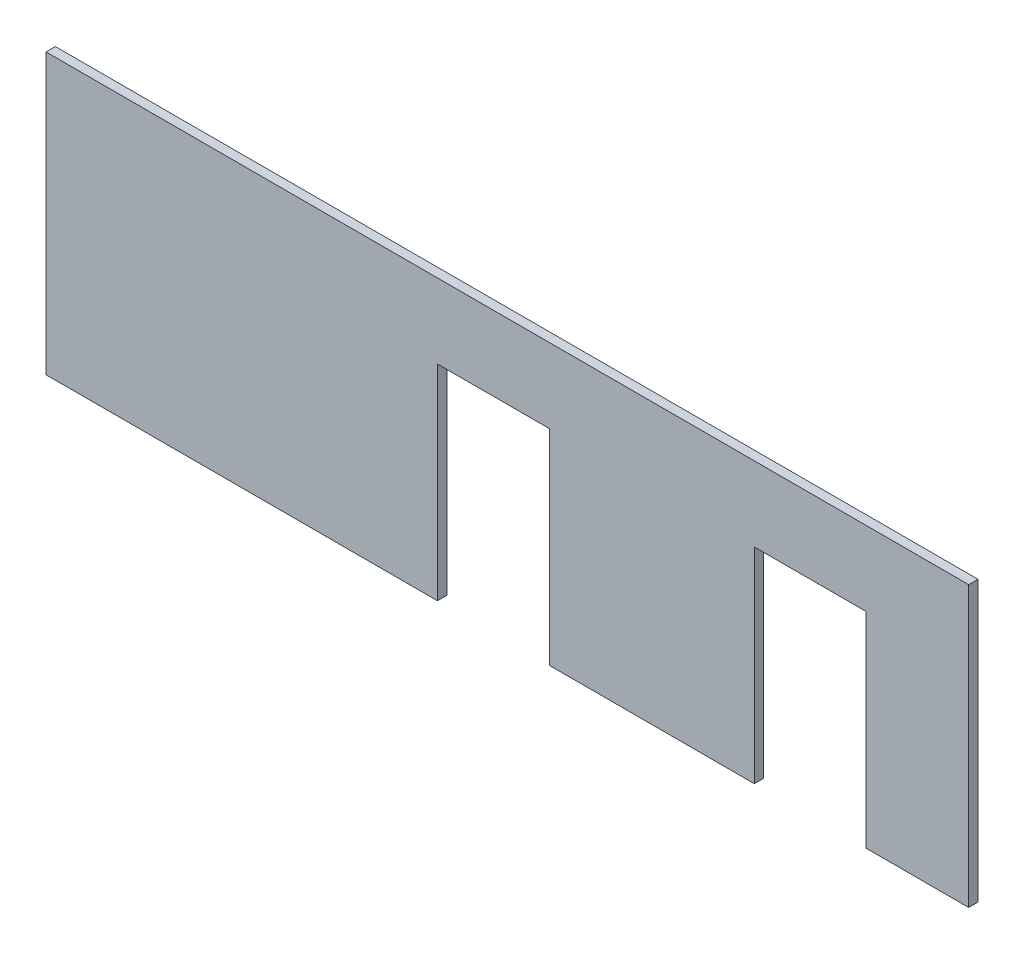
ISO-10303-21;
HEADER;
FILE_DESCRIPTION(('STEP AP214'),'2;1');
FILE_NAME('part.step','',(''),(''),'','','');
FILE_SCHEMA(('AUTOMOTIVE_DESIGN { 1 0 10303 214 1 1 1 1 }'));
ENDSEC;
DATA;
#1=APPLICATION_CONTEXT('core data for automotive mechanical design processes');
#2=APPLICATION_PROTOCOL_DEFINITION('international standard','automotive_design',2000,#1);
#3=PRODUCT_CONTEXT('',#1,'mechanical');
#4=PRODUCT('Part','Part','',(#3));
#5=PRODUCT_RELATED_PRODUCT_CATEGORY('part','',(#4));
#6=PRODUCT_DEFINITION_FORMATION('','',#4);
#7=PRODUCT_DEFINITION_CONTEXT('part definition',#1,'design');
#8=PRODUCT_DEFINITION('design','',#6,#7);
#9=PRODUCT_DEFINITION_SHAPE('','',#8);
#10=(LENGTH_UNIT() NAMED_UNIT(*) SI_UNIT(.MILLI.,.METRE.));
#11=(NAMED_UNIT(*) PLANE_ANGLE_UNIT() SI_UNIT($,.RADIAN.));
#12=(NAMED_UNIT(*) SI_UNIT($,.STERADIAN.) SOLID_ANGLE_UNIT());
#13=UNCERTAINTY_MEASURE_WITH_UNIT(LENGTH_MEASURE(1.E-05),#10,'distance_accuracy_value','');
#14=(GEOMETRIC_REPRESENTATION_CONTEXT(3) GLOBAL_UNCERTAINTY_ASSIGNED_CONTEXT((#13)) GLOBAL_UNIT_ASSIGNED_CONTEXT((#10,
#11,#12)) REPRESENTATION_CONTEXT('',''));
#15=CARTESIAN_POINT('',(0.,0.,0.));
#16=DIRECTION('',(0.,0.,1.));
#17=DIRECTION('',(1.,0.,0.));
#18=AXIS2_PLACEMENT_3D('',#15,#16,#17);
#19=CARTESIAN_POINT('',(192.5,-75.,5.));
#20=DIRECTION('',(0.,1.,0.));
#21=DIRECTION('',(0.,0.,1.));
#22=AXIS2_PLACEMENT_3D('',#19,#20,#21);
#23=PLANE('',#22);
#24=DIRECTION('',(1.,0.,0.));
#25=VECTOR('',#24,1.);
#26=CARTESIAN_POINT('',(192.5,-75.,0.));
#27=LINE('',#26,#25);
#28=CARTESIAN_POINT('',(192.5,-75.,0.));
#29=VERTEX_POINT('',#28);
#30=CARTESIAN_POINT('',(247.5,-75.,0.));
#31=VERTEX_POINT('',#30);
#32=EDGE_CURVE('E153',#29,#31,#27,.T.);
#33=ORIENTED_EDGE('',*,*,#32,.T.);
#34=DIRECTION('',(0.,0.,-1.));
#35=VECTOR('',#34,1.);
#36=CARTESIAN_POINT('',(247.5,-75.,5.));
#37=LINE('',#36,#35);
#38=CARTESIAN_POINT('',(247.5,-75.,5.));
#39=VERTEX_POINT('',#38);
#40=EDGE_CURVE('E11',#39,#31,#37,.T.);
#41=ORIENTED_EDGE('',*,*,#40,.F.);
#42=DIRECTION('',(1.,0.,0.));
#43=VECTOR('',#42,1.);
#44=CARTESIAN_POINT('',(192.5,-75.,5.));
#45=LINE('',#44,#43);
#46=CARTESIAN_POINT('',(192.5,-75.,5.));
#47=VERTEX_POINT('',#46);
#48=EDGE_CURVE('E175',#47,#39,#45,.T.);
#49=ORIENTED_EDGE('',*,*,#48,.F.);
#50=DIRECTION('',(0.,0.,-1.));
#51=VECTOR('',#50,1.);
#52=CARTESIAN_POINT('',(192.5,-75.,5.));
#53=LINE('',#52,#51);
#54=EDGE_CURVE('E149',#47,#29,#53,.T.);
#55=ORIENTED_EDGE('',*,*,#54,.T.);
#56=EDGE_LOOP('',(#33,#41,#49,#55));
#57=FACE_BOUND('',#56,.T.);
#58=ADVANCED_FACE('F33',(#57),#23,.F.);
#59=CARTESIAN_POINT('',(247.5,75.,5.));
#60=DIRECTION('',(-1.,0.,0.));
#61=DIRECTION('',(0.,-1.,0.));
#62=AXIS2_PLACEMENT_3D('',#59,#60,#61);
#63=PLANE('',#62);
#64=DIRECTION('',(0.,1.,0.));
#65=VECTOR('',#64,1.);
#66=CARTESIAN_POINT('',(247.5,75.,0.));
#67=LINE('',#66,#65);
#68=CARTESIAN_POINT('',(247.5,75.,0.));
#69=VERTEX_POINT('',#68);
#70=EDGE_CURVE('E156',#31,#69,#67,.T.);
#71=ORIENTED_EDGE('',*,*,#70,.T.);
#72=DIRECTION('',(0.,0.,-1.));
#73=VECTOR('',#72,1.);
#74=CARTESIAN_POINT('',(247.5,75.,5.));
#75=LINE('',#74,#73);
#76=CARTESIAN_POINT('',(247.5,75.,5.));
#77=VERTEX_POINT('',#76);
#78=EDGE_CURVE('E41',#77,#69,#75,.T.);
#79=ORIENTED_EDGE('',*,*,#78,.F.);
#80=DIRECTION('',(0.,1.,0.));
#81=VECTOR('',#80,1.);
#82=CARTESIAN_POINT('',(247.5,75.,5.));
#83=LINE('',#82,#81);
#84=EDGE_CURVE('E104',#39,#77,#83,.T.);
#85=ORIENTED_EDGE('',*,*,#84,.F.);
#86=ORIENTED_EDGE('',*,*,#40,.T.);
#87=EDGE_LOOP('',(#71,#79,#85,#86));
#88=FACE_BOUND('',#87,.T.);
#89=ADVANCED_FACE('F253',(#88),#63,.F.);
#90=CARTESIAN_POINT('',(-247.5,75.,5.));
#91=DIRECTION('',(0.,-1.,0.));
#92=DIRECTION('',(0.,0.,-1.));
#93=AXIS2_PLACEMENT_3D('',#90,#91,#92);
#94=PLANE('',#93);
#95=DIRECTION('',(-1.,0.,0.));
#96=VECTOR('',#95,1.);
#97=CARTESIAN_POINT('',(-247.5,75.,0.));
#98=LINE('',#97,#96);
#99=CARTESIAN_POINT('',(-247.5,75.,0.));
#100=VERTEX_POINT('',#99);
#101=EDGE_CURVE('E158',#69,#100,#98,.T.);
#102=ORIENTED_EDGE('',*,*,#101,.T.);
#103=DIRECTION('',(0.,0.,-1.));
#104=VECTOR('',#103,1.);
#105=CARTESIAN_POINT('',(-247.5,75.,5.));
#106=LINE('',#105,#104);
#107=CARTESIAN_POINT('',(-247.5,75.,5.));
#108=VERTEX_POINT('',#107);
#109=EDGE_CURVE('E194',#108,#100,#106,.T.);
#110=ORIENTED_EDGE('',*,*,#109,.F.);
#111=DIRECTION('',(-1.,0.,0.));
#112=VECTOR('',#111,1.);
#113=CARTESIAN_POINT('',(-247.5,75.,5.));
#114=LINE('',#113,#112);
#115=EDGE_CURVE('E202',#77,#108,#114,.T.);
#116=ORIENTED_EDGE('',*,*,#115,.F.);
#117=ORIENTED_EDGE('',*,*,#78,.T.);
#118=EDGE_LOOP('',(#102,#110,#116,#117));
#119=FACE_BOUND('',#118,.T.);
#120=ADVANCED_FACE('F200',(#119),#94,.F.);
#121=CARTESIAN_POINT('',(-247.5,75.,5.));
#122=DIRECTION('',(1.,0.,0.));
#123=DIRECTION('',(0.,1.,0.));
#124=AXIS2_PLACEMENT_3D('',#121,#122,#123);
#125=PLANE('',#124);
#126=DIRECTION('',(0.,-1.,0.));
#127=VECTOR('',#126,1.);
#128=CARTESIAN_POINT('',(-247.5,75.,0.));
#129=LINE('',#128,#127);
#130=CARTESIAN_POINT('',(-247.5,-75.,0.));
#131=VERTEX_POINT('',#130);
#132=EDGE_CURVE('E160',#100,#131,#129,.T.);
#133=ORIENTED_EDGE('',*,*,#132,.T.);
#134=DIRECTION('',(0.,0.,-1.));
#135=VECTOR('',#134,1.);
#136=CARTESIAN_POINT('',(-247.5,-75.,5.));
#137=LINE('',#136,#135);
#138=CARTESIAN_POINT('',(-247.5,-75.,5.));
#139=VERTEX_POINT('',#138);
#140=EDGE_CURVE('E191',#139,#131,#137,.T.);
#141=ORIENTED_EDGE('',*,*,#140,.F.);
#142=DIRECTION('',(0.,-1.,0.));
#143=VECTOR('',#142,1.);
#144=CARTESIAN_POINT('',(-247.5,75.,5.));
#145=LINE('',#144,#143);
#146=EDGE_CURVE('E220',#108,#139,#145,.T.);
#147=ORIENTED_EDGE('',*,*,#146,.F.);
#148=ORIENTED_EDGE('',*,*,#109,.T.);
#149=EDGE_LOOP('',(#133,#141,#147,#148));
#150=FACE_BOUND('',#149,.T.);
#151=ADVANCED_FACE('F211',(#150),#125,.F.);
#152=CARTESIAN_POINT('',(-247.5,-75.,5.));
#153=DIRECTION('',(0.,1.,0.));
#154=DIRECTION('',(-1.,0.,0.));
#155=AXIS2_PLACEMENT_3D('',#152,#153,#154);
#156=PLANE('',#155);
#157=DIRECTION('',(1.,0.,0.));
#158=VECTOR('',#157,1.);
#159=CARTESIAN_POINT('',(-247.5,-75.,0.));
#160=LINE('',#159,#158);
#161=CARTESIAN_POINT('',(-37.4999999999999,-75.,0.));
#162=VERTEX_POINT('',#161);
#163=EDGE_CURVE('E162',#131,#162,#160,.T.);
#164=ORIENTED_EDGE('',*,*,#163,.T.);
#165=DIRECTION('',(0.,0.,-1.));
#166=VECTOR('',#165,1.);
#167=CARTESIAN_POINT('',(-37.4999999999999,-75.,5.));
#168=LINE('',#167,#166);
#169=CARTESIAN_POINT('',(-37.4999999999999,-75.,5.));
#170=VERTEX_POINT('',#169);
#171=EDGE_CURVE('E188',#170,#162,#168,.T.);
#172=ORIENTED_EDGE('',*,*,#171,.F.);
#173=DIRECTION('',(1.,0.,0.));
#174=VECTOR('',#173,1.);
#175=CARTESIAN_POINT('',(-247.5,-75.,5.));
#176=LINE('',#175,#174);
#177=EDGE_CURVE('E217',#139,#170,#176,.T.);
#178=ORIENTED_EDGE('',*,*,#177,.F.);
#179=ORIENTED_EDGE('',*,*,#140,.T.);
#180=EDGE_LOOP('',(#164,#172,#178,#179));
#181=FACE_BOUND('',#180,.T.);
#182=ADVANCED_FACE('F215',(#181),#156,.F.);
#183=CARTESIAN_POINT('',(-37.5,35.0000000000003,5.));
#184=DIRECTION('',(-1.,0.,0.));
#185=DIRECTION('',(0.,-1.,0.));
#186=AXIS2_PLACEMENT_3D('',#183,#184,#185);
#187=PLANE('',#186);
#188=DIRECTION('',(0.,1.,0.));
#189=VECTOR('',#188,1.);
#190=CARTESIAN_POINT('',(-37.5,35.0000000000003,0.));
#191=LINE('',#190,#189);
#192=CARTESIAN_POINT('',(-37.5,35.0000000000003,0.));
#193=VERTEX_POINT('',#192);
#194=EDGE_CURVE('E164',#162,#193,#191,.T.);
#195=ORIENTED_EDGE('',*,*,#194,.T.);
#196=DIRECTION('',(0.,0.,-1.));
#197=VECTOR('',#196,1.);
#198=CARTESIAN_POINT('',(-37.5,35.0000000000003,5.));
#199=LINE('',#198,#197);
#200=CARTESIAN_POINT('',(-37.5,35.0000000000003,5.));
#201=VERTEX_POINT('',#200);
#202=EDGE_CURVE('E185',#201,#193,#199,.T.);
#203=ORIENTED_EDGE('',*,*,#202,.F.);
#204=DIRECTION('',(0.,1.,0.));
#205=VECTOR('',#204,1.);
#206=CARTESIAN_POINT('',(-37.5,35.0000000000003,5.));
#207=LINE('',#206,#205);
#208=EDGE_CURVE('E219',#170,#201,#207,.T.);
#209=ORIENTED_EDGE('',*,*,#208,.F.);
#210=ORIENTED_EDGE('',*,*,#171,.T.);
#211=EDGE_LOOP('',(#195,#203,#209,#210));
#212=FACE_BOUND('',#211,.T.);
#213=ADVANCED_FACE('F266',(#212),#187,.F.);
#214=CARTESIAN_POINT('',(22.5,35.0000000000004,5.));
#215=DIRECTION('',(0.,1.,0.));
#216=DIRECTION('',(-1.,0.,0.));
#217=AXIS2_PLACEMENT_3D('',#214,#215,#216);
#218=PLANE('',#217);
#219=DIRECTION('',(1.,0.,0.));
#220=VECTOR('',#219,1.);
#221=CARTESIAN_POINT('',(22.5,35.0000000000004,0.));
#222=LINE('',#221,#220);
#223=CARTESIAN_POINT('',(22.5,35.0000000000004,0.));
#224=VERTEX_POINT('',#223);
#225=EDGE_CURVE('E166',#193,#224,#222,.T.);
#226=ORIENTED_EDGE('',*,*,#225,.T.);
#227=DIRECTION('',(0.,0.,-1.));
#228=VECTOR('',#227,1.);
#229=CARTESIAN_POINT('',(22.5,35.0000000000004,5.));
#230=LINE('',#229,#228);
#231=CARTESIAN_POINT('',(22.5,35.0000000000004,5.));
#232=VERTEX_POINT('',#231);
#233=EDGE_CURVE('E182',#232,#224,#230,.T.);
#234=ORIENTED_EDGE('',*,*,#233,.F.);
#235=DIRECTION('',(1.,0.,0.));
#236=VECTOR('',#235,1.);
#237=CARTESIAN_POINT('',(22.5,35.0000000000004,5.));
#238=LINE('',#237,#236);
#239=EDGE_CURVE('E222',#201,#232,#238,.T.);
#240=ORIENTED_EDGE('',*,*,#239,.F.);
#241=ORIENTED_EDGE('',*,*,#202,.T.);
#242=EDGE_LOOP('',(#226,#234,#240,#241));
#243=FACE_BOUND('',#242,.T.);
#244=ADVANCED_FACE('F269',(#243),#218,.F.);
#245=CARTESIAN_POINT('',(22.5000000000001,-75.,5.));
#246=DIRECTION('',(1.,0.,0.));
#247=DIRECTION('',(0.,1.,0.));
#248=AXIS2_PLACEMENT_3D('',#245,#246,#247);
#249=PLANE('',#248);
#250=DIRECTION('',(0.,-1.,0.));
#251=VECTOR('',#250,1.);
#252=CARTESIAN_POINT('',(22.5000000000001,-75.,0.));
#253=LINE('',#252,#251);
#254=CARTESIAN_POINT('',(22.5000000000001,-75.,0.));
#255=VERTEX_POINT('',#254);
#256=EDGE_CURVE('E168',#224,#255,#253,.T.);
#257=ORIENTED_EDGE('',*,*,#256,.T.);
#258=DIRECTION('',(0.,0.,-1.));
#259=VECTOR('',#258,1.);
#260=CARTESIAN_POINT('',(22.5000000000001,-75.,5.));
#261=LINE('',#260,#259);
#262=CARTESIAN_POINT('',(22.5000000000001,-75.,5.));
#263=VERTEX_POINT('',#262);
#264=EDGE_CURVE('E179',#263,#255,#261,.T.);
#265=ORIENTED_EDGE('',*,*,#264,.F.);
#266=DIRECTION('',(0.,-1.,0.));
#267=VECTOR('',#266,1.);
#268=CARTESIAN_POINT('',(22.5000000000001,-75.,5.));
#269=LINE('',#268,#267);
#270=EDGE_CURVE('E228',#232,#263,#269,.T.);
#271=ORIENTED_EDGE('',*,*,#270,.F.);
#272=ORIENTED_EDGE('',*,*,#233,.T.);
#273=EDGE_LOOP('',(#257,#265,#271,#272));
#274=FACE_BOUND('',#273,.T.);
#275=ADVANCED_FACE('F234',(#274),#249,.F.);
#276=CARTESIAN_POINT('',(22.5000000000001,-75.,5.));
#277=DIRECTION('',(0.,1.,0.));
#278=DIRECTION('',(-1.,0.,0.));
#279=AXIS2_PLACEMENT_3D('',#276,#277,#278);
#280=PLANE('',#279);
#281=DIRECTION('',(1.,0.,0.));
#282=VECTOR('',#281,1.);
#283=CARTESIAN_POINT('',(22.5000000000001,-75.,0.));
#284=LINE('',#283,#282);
#285=CARTESIAN_POINT('',(132.5,-75.,0.));
#286=VERTEX_POINT('',#285);
#287=EDGE_CURVE('E170',#255,#286,#284,.T.);
#288=ORIENTED_EDGE('',*,*,#287,.T.);
#289=DIRECTION('',(0.,0.,-1.));
#290=VECTOR('',#289,1.);
#291=CARTESIAN_POINT('',(132.5,-75.,5.));
#292=LINE('',#291,#290);
#293=CARTESIAN_POINT('',(132.5,-75.,5.));
#294=VERTEX_POINT('',#293);
#295=EDGE_CURVE('E144',#294,#286,#292,.T.);
#296=ORIENTED_EDGE('',*,*,#295,.F.);
#297=DIRECTION('',(1.,0.,0.));
#298=VECTOR('',#297,1.);
#299=CARTESIAN_POINT('',(22.5000000000001,-75.,5.));
#300=LINE('',#299,#298);
#301=EDGE_CURVE('E135',#263,#294,#300,.T.);
#302=ORIENTED_EDGE('',*,*,#301,.F.);
#303=ORIENTED_EDGE('',*,*,#264,.T.);
#304=EDGE_LOOP('',(#288,#296,#302,#303));
#305=FACE_BOUND('',#304,.T.);
#306=ADVANCED_FACE('F238',(#305),#280,.F.);
#307=CARTESIAN_POINT('',(132.5,35.,5.));
#308=DIRECTION('',(-1.,0.,0.));
#309=DIRECTION('',(0.,0.,1.));
#310=AXIS2_PLACEMENT_3D('',#307,#308,#309);
#311=PLANE('',#310);
#312=DIRECTION('',(0.,1.,0.));
#313=VECTOR('',#312,1.);
#314=CARTESIAN_POINT('',(132.5,35.,0.));
#315=LINE('',#314,#313);
#316=CARTESIAN_POINT('',(132.5,35.,0.));
#317=VERTEX_POINT('',#316);
#318=EDGE_CURVE('E143',#286,#317,#315,.T.);
#319=ORIENTED_EDGE('',*,*,#318,.T.);
#320=DIRECTION('',(0.,0.,-1.));
#321=VECTOR('',#320,1.);
#322=CARTESIAN_POINT('',(132.5,35.,5.));
#323=LINE('',#322,#321);
#324=CARTESIAN_POINT('',(132.5,35.,5.));
#325=VERTEX_POINT('',#324);
#326=EDGE_CURVE('E140',#325,#317,#323,.T.);
#327=ORIENTED_EDGE('',*,*,#326,.F.);
#328=DIRECTION('',(0.,1.,0.));
#329=VECTOR('',#328,1.);
#330=CARTESIAN_POINT('',(132.5,35.,5.));
#331=LINE('',#330,#329);
#332=EDGE_CURVE('E129',#294,#325,#331,.T.);
#333=ORIENTED_EDGE('',*,*,#332,.F.);
#334=ORIENTED_EDGE('',*,*,#295,.T.);
#335=EDGE_LOOP('',(#319,#327,#333,#334));
#336=FACE_BOUND('',#335,.T.);
#337=ADVANCED_FACE('F141',(#336),#311,.F.);
#338=CARTESIAN_POINT('',(132.5,35.,5.));
#339=DIRECTION('',(0.,1.,0.));
#340=DIRECTION('',(-1.,0.,0.));
#341=AXIS2_PLACEMENT_3D('',#338,#339,#340);
#342=PLANE('',#341);
#343=DIRECTION('',(1.,0.,0.));
#344=VECTOR('',#343,1.);
#345=CARTESIAN_POINT('',(132.5,35.,0.));
#346=LINE('',#345,#344);
#347=CARTESIAN_POINT('',(192.5,35.,0.));
#348=VERTEX_POINT('',#347);
#349=EDGE_CURVE('E90',#317,#348,#346,.T.);
#350=ORIENTED_EDGE('',*,*,#349,.T.);
#351=DIRECTION('',(0.,0.,-1.));
#352=VECTOR('',#351,1.);
#353=CARTESIAN_POINT('',(192.5,35.,5.));
#354=LINE('',#353,#352);
#355=CARTESIAN_POINT('',(192.5,35.,5.));
#356=VERTEX_POINT('',#355);
#357=EDGE_CURVE('E145',#356,#348,#354,.T.);
#358=ORIENTED_EDGE('',*,*,#357,.F.);
#359=DIRECTION('',(1.,0.,0.));
#360=VECTOR('',#359,1.);
#361=CARTESIAN_POINT('',(132.5,35.,5.));
#362=LINE('',#361,#360);
#363=EDGE_CURVE('E133',#325,#356,#362,.T.);
#364=ORIENTED_EDGE('',*,*,#363,.F.);
#365=ORIENTED_EDGE('',*,*,#326,.T.);
#366=EDGE_LOOP('',(#350,#358,#364,#365));
#367=FACE_BOUND('',#366,.T.);
#368=ADVANCED_FACE('F147',(#367),#342,.F.);
#369=CARTESIAN_POINT('',(192.5,-75.,5.));
#370=DIRECTION('',(1.,0.,0.));
#371=DIRECTION('',(0.,1.,0.));
#372=AXIS2_PLACEMENT_3D('',#369,#370,#371);
#373=PLANE('',#372);
#374=DIRECTION('',(0.,-1.,0.));
#375=VECTOR('',#374,1.);
#376=CARTESIAN_POINT('',(192.5,-75.,0.));
#377=LINE('',#376,#375);
#378=EDGE_CURVE('E96',#348,#29,#377,.T.);
#379=ORIENTED_EDGE('',*,*,#378,.T.);
#380=ORIENTED_EDGE('',*,*,#54,.F.);
#381=DIRECTION('',(0.,-1.,0.));
#382=VECTOR('',#381,1.);
#383=CARTESIAN_POINT('',(192.5,-75.,5.));
#384=LINE('',#383,#382);
#385=EDGE_CURVE('E49',#356,#47,#384,.T.);
#386=ORIENTED_EDGE('',*,*,#385,.F.);
#387=ORIENTED_EDGE('',*,*,#357,.T.);
#388=EDGE_LOOP('',(#379,#380,#386,#387));
#389=FACE_BOUND('',#388,.T.);
#390=ADVANCED_FACE('F242',(#389),#373,.F.);
#391=CARTESIAN_POINT('',(0.,0.,5.));
#392=DIRECTION('',(0.,0.,-1.));
#393=DIRECTION('',(-1.,0.,0.));
#394=AXIS2_PLACEMENT_3D('',#391,#392,#393);
#395=PLANE('',#394);
#396=ORIENTED_EDGE('',*,*,#48,.T.);
#397=ORIENTED_EDGE('',*,*,#84,.T.);
#398=ORIENTED_EDGE('',*,*,#115,.T.);
#399=ORIENTED_EDGE('',*,*,#146,.T.);
#400=ORIENTED_EDGE('',*,*,#177,.T.);
#401=ORIENTED_EDGE('',*,*,#208,.T.);
#402=ORIENTED_EDGE('',*,*,#239,.T.);
#403=ORIENTED_EDGE('',*,*,#270,.T.);
#404=ORIENTED_EDGE('',*,*,#301,.T.);
#405=ORIENTED_EDGE('',*,*,#332,.T.);
#406=ORIENTED_EDGE('',*,*,#363,.T.);
#407=ORIENTED_EDGE('',*,*,#385,.T.);
#408=EDGE_LOOP('',(#396,#397,#398,#399,#400,#401,#402,#403,#404,#405,#406,#407));
#409=FACE_BOUND('',#408,.T.);
#410=ADVANCED_FACE('F131',(#409),#395,.F.);
#411=CARTESIAN_POINT('',(0.,0.,0.));
#412=DIRECTION('',(0.,0.,-1.));
#413=DIRECTION('',(-1.,0.,0.));
#414=AXIS2_PLACEMENT_3D('',#411,#412,#413);
#415=PLANE('',#414);
#416=ORIENTED_EDGE('',*,*,#32,.F.);
#417=ORIENTED_EDGE('',*,*,#378,.F.);
#418=ORIENTED_EDGE('',*,*,#349,.F.);
#419=ORIENTED_EDGE('',*,*,#318,.F.);
#420=ORIENTED_EDGE('',*,*,#287,.F.);
#421=ORIENTED_EDGE('',*,*,#256,.F.);
#422=ORIENTED_EDGE('',*,*,#225,.F.);
#423=ORIENTED_EDGE('',*,*,#194,.F.);
#424=ORIENTED_EDGE('',*,*,#163,.F.);
#425=ORIENTED_EDGE('',*,*,#132,.F.);
#426=ORIENTED_EDGE('',*,*,#101,.F.);
#427=ORIENTED_EDGE('',*,*,#70,.F.);
#428=EDGE_LOOP('',(#416,#417,#418,#419,#420,#421,#422,#423,#424,#425,#426,#427));
#429=FACE_BOUND('',#428,.T.);
#430=ADVANCED_FACE('F206',(#429),#415,.T.);
#431=CLOSED_SHELL('',(#58,#89,#120,#151,#182,#213,#244,#275,#306,#337,#368,#390,#410,#430));
#432=MANIFOLD_SOLID_BREP('B2',#431);
#433=ADVANCED_BREP_SHAPE_REPRESENTATION('',(#18,#432),#14);
#434=SHAPE_DEFINITION_REPRESENTATION(#9,#433);
ENDSEC;
END-ISO-10303-21;
